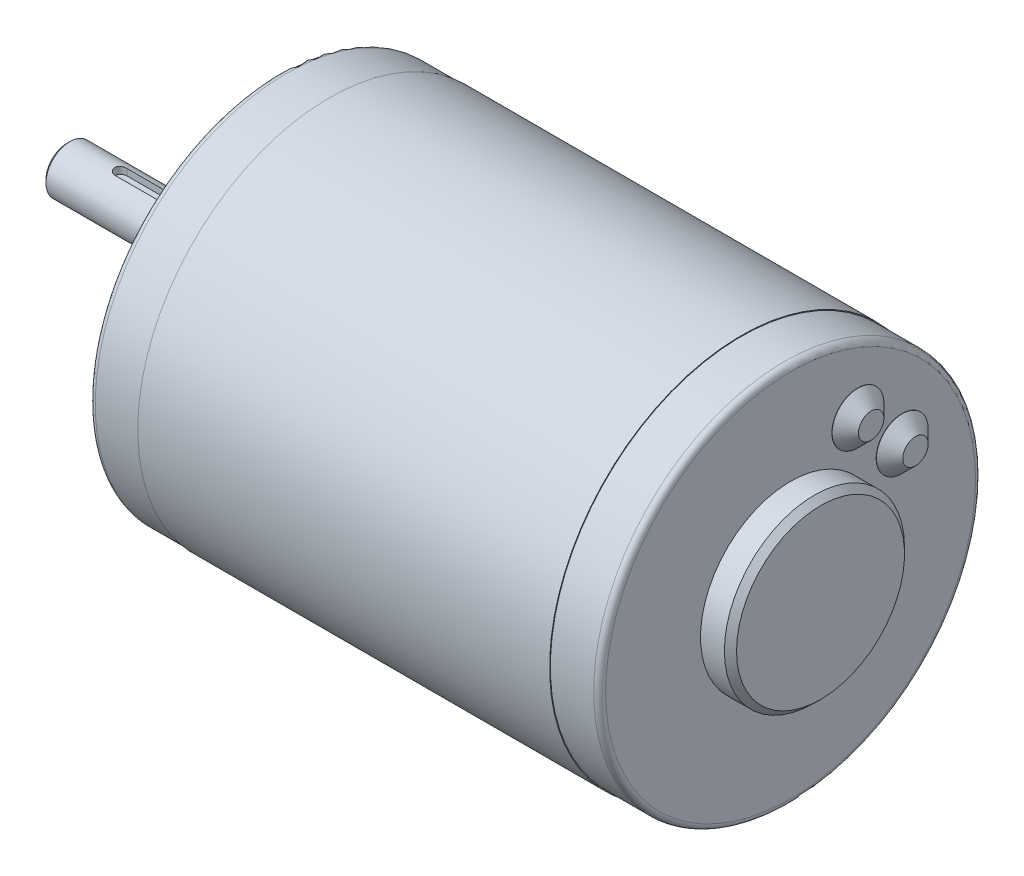
ISO-10303-21;
HEADER;
FILE_DESCRIPTION(('STEP AP214'),'2;1');
FILE_NAME('part.step','',(''),(''),'','','');
FILE_SCHEMA(('AUTOMOTIVE_DESIGN { 1 0 10303 214 1 1 1 1 }'));
ENDSEC;
DATA;
#1=APPLICATION_CONTEXT('core data for automotive mechanical design processes');
#2=APPLICATION_PROTOCOL_DEFINITION('international standard','automotive_design',2000,#1);
#3=PRODUCT_CONTEXT('',#1,'mechanical');
#4=PRODUCT('Part','Part','',(#3));
#5=PRODUCT_RELATED_PRODUCT_CATEGORY('part','',(#4));
#6=PRODUCT_DEFINITION_FORMATION('','',#4);
#7=PRODUCT_DEFINITION_CONTEXT('part definition',#1,'design');
#8=PRODUCT_DEFINITION('design','',#6,#7);
#9=PRODUCT_DEFINITION_SHAPE('','',#8);
#10=(LENGTH_UNIT() NAMED_UNIT(*) SI_UNIT(.MILLI.,.METRE.));
#11=(NAMED_UNIT(*) PLANE_ANGLE_UNIT() SI_UNIT($,.RADIAN.));
#12=(NAMED_UNIT(*) SI_UNIT($,.STERADIAN.) SOLID_ANGLE_UNIT());
#13=UNCERTAINTY_MEASURE_WITH_UNIT(LENGTH_MEASURE(1.E-05),#10,'distance_accuracy_value','');
#14=(GEOMETRIC_REPRESENTATION_CONTEXT(3) GLOBAL_UNCERTAINTY_ASSIGNED_CONTEXT((#13)) GLOBAL_UNIT_ASSIGNED_CONTEXT((#10,
#11,#12)) REPRESENTATION_CONTEXT('',''));
#15=CARTESIAN_POINT('',(0.,0.,0.));
#16=DIRECTION('',(0.,0.,1.));
#17=DIRECTION('',(1.,0.,0.));
#18=AXIS2_PLACEMENT_3D('',#15,#16,#17);
#19=CARTESIAN_POINT('',(-27.6,2.79999999999999,-1.));
#20=DIRECTION('',(0.,-1.,0.));
#21=DIRECTION('',(0.,0.,-1.));
#22=AXIS2_PLACEMENT_3D('',#19,#20,#21);
#23=PLANE('',#22);
#24=CARTESIAN_POINT('',(-7.1,2.79999999999999,0.));
#25=DIRECTION('',(0.,1.,0.));
#26=DIRECTION('',(0.,0.,1.));
#27=AXIS2_PLACEMENT_3D('',#24,#25,#26);
#28=CIRCLE('',#27,1.);
#29=CARTESIAN_POINT('',(-7.1,2.79999999999999,1.));
#30=VERTEX_POINT('',#29);
#31=CARTESIAN_POINT('',(-7.1,2.79999999999999,-1.));
#32=VERTEX_POINT('',#31);
#33=EDGE_CURVE('E81',#30,#32,#28,.T.);
#34=ORIENTED_EDGE('',*,*,#33,.T.);
#35=DIRECTION('',(1.,0.,0.));
#36=VECTOR('',#35,1.);
#37=CARTESIAN_POINT('',(-27.6,2.79999999999999,-1.));
#38=LINE('',#37,#36);
#39=CARTESIAN_POINT('',(-26.6,2.79999999999999,-1.));
#40=VERTEX_POINT('',#39);
#41=EDGE_CURVE('E76',#40,#32,#38,.T.);
#42=ORIENTED_EDGE('',*,*,#41,.F.);
#43=CARTESIAN_POINT('',(-26.6,2.79999999999999,0.));
#44=DIRECTION('',(0.,-1.,0.));
#45=DIRECTION('',(0.,0.,-1.));
#46=AXIS2_PLACEMENT_3D('',#43,#44,#45);
#47=CIRCLE('',#46,1.);
#48=CARTESIAN_POINT('',(-26.6,2.79999999999999,1.));
#49=VERTEX_POINT('',#48);
#50=EDGE_CURVE('E78',#40,#49,#47,.F.);
#51=ORIENTED_EDGE('',*,*,#50,.T.);
#52=DIRECTION('',(1.,0.,0.));
#53=VECTOR('',#52,1.);
#54=CARTESIAN_POINT('',(-27.6,2.79999999999999,1.));
#55=LINE('',#54,#53);
#56=EDGE_CURVE('E104',#49,#30,#55,.T.);
#57=ORIENTED_EDGE('',*,*,#56,.T.);
#58=EDGE_LOOP('',(#34,#42,#51,#57));
#59=FACE_BOUND('',#58,.T.);
#60=ADVANCED_FACE('F18',(#59),#23,.F.);
#61=CARTESIAN_POINT('',(-35.6,0.,0.));
#62=DIRECTION('',(-1.,0.,0.));
#63=DIRECTION('',(0.,0.,1.));
#64=AXIS2_PLACEMENT_3D('',#61,#62,#63);
#65=PLANE('',#64);
#66=CARTESIAN_POINT('',(-35.6000000000449,0.,0.));
#67=DIRECTION('',(1.,0.,0.));
#68=DIRECTION('',(0.,0.,-1.));
#69=AXIS2_PLACEMENT_3D('',#66,#67,#68);
#70=CIRCLE('',#69,3.49999999997408);
#71=CARTESIAN_POINT('',(-35.6000000000449,0.,-3.49999999997408));
#72=VERTEX_POINT('',#71);
#73=EDGE_CURVE('E326',#72,#72,#70,.T.);
#74=ORIENTED_EDGE('',*,*,#73,.F.);
#75=EDGE_LOOP('',(#74));
#76=FACE_BOUND('',#75,.T.);
#77=ADVANCED_FACE('F582',(#76),#65,.T.);
#78=CARTESIAN_POINT('',(-26.6,3.87298334620741,0.));
#79=DIRECTION('',(0.,-1.,0.));
#80=DIRECTION('',(0.,0.,-1.));
#81=AXIS2_PLACEMENT_3D('',#78,#79,#80);
#82=CYLINDRICAL_SURFACE('',#81,1.);
#83=CARTESIAN_POINT('',(-26.6,3.87298334620741,1.));
#84=CARTESIAN_POINT('',(-26.6276629851065,3.87298148580177,1.00000033749611));
#85=CARTESIAN_POINT('',(-26.6553122630182,3.8732800994947,0.998851407375366));
#86=CARTESIAN_POINT('',(-26.7104040353036,3.87445904774558,0.994271295395754));
#87=CARTESIAN_POINT('',(-26.7378465636871,3.87533928441687,0.990840497572679));
#88=CARTESIAN_POINT('',(-26.8194531732088,3.87881710972053,0.977175239382526));
#89=CARTESIAN_POINT('',(-26.8730564684822,3.88225203148808,0.963567695172493));
#90=CARTESIAN_POINT('',(-26.977124673782,3.89095422588002,0.927798076247996));
#91=CARTESIAN_POINT('',(-27.0275898782129,3.89622132630929,0.905636805423835));
#92=CARTESIAN_POINT('',(-27.1241114486473,3.90799134471939,0.853415378025864));
#93=CARTESIAN_POINT('',(-27.170166627891,3.91449459395647,0.823353103356932));
#94=CARTESIAN_POINT('',(-27.2575438819061,3.92816262398025,0.755484471828069));
#95=CARTESIAN_POINT('',(-27.2987548862455,3.93533791028915,0.717537268783975));
#96=CARTESIAN_POINT('',(-27.3743020894827,3.94945104396193,0.635275780516229));
#97=CARTESIAN_POINT('',(-27.4086371894679,3.95638885322537,0.59096047947883));
#98=CARTESIAN_POINT('',(-27.4699110016186,3.96936182283248,0.496456899401689));
#99=CARTESIAN_POINT('',(-27.496739895984,3.9753830468173,0.446195340334472));
#100=CARTESIAN_POINT('',(-27.5415247341967,3.98572346250588,0.341702590842916));
#101=CARTESIAN_POINT('',(-27.5594824242998,3.990042989147,0.287472184083007));
#102=CARTESIAN_POINT('',(-27.5856589927774,3.99641900005128,0.177744108525158));
#103=CARTESIAN_POINT('',(-27.5940676724228,3.998519529013,0.122294322002856));
#104=CARTESIAN_POINT('',(-27.6015033715433,4.00037438150815,0.0107327756816781));
#105=CARTESIAN_POINT('',(-27.6005315701923,4.00012899993444,-0.0453789000287067));
#106=CARTESIAN_POINT('',(-27.5893700363146,3.99735237365735,-0.155352492972096));
#107=CARTESIAN_POINT('',(-27.5793853834005,3.9948719867736,-0.209236701739855));
#108=CARTESIAN_POINT('',(-27.5508113208173,3.98796330636495,-0.31453871108434));
#109=CARTESIAN_POINT('',(-27.5322215304314,3.98353492665556,-0.365956402423988));
#110=CARTESIAN_POINT('',(-27.4867987193294,3.97314997761798,-0.46540728602454));
#111=CARTESIAN_POINT('',(-27.4598926057672,3.96717993827555,-0.513405629602248));
#112=CARTESIAN_POINT('',(-27.3986568701665,3.95435945541919,-0.604276631230015));
#113=CARTESIAN_POINT('',(-27.3643261297468,3.94750887933198,-0.64714851556229));
#114=CARTESIAN_POINT('',(-27.2881210879187,3.93345566022865,-0.727769389708492));
#115=CARTESIAN_POINT('',(-27.2460683634602,3.92624850477685,-0.765349103054128));
#116=CARTESIAN_POINT('',(-27.1561701330723,3.91246168284006,-0.832969575186237));
#117=CARTESIAN_POINT('',(-27.1083230467164,3.90588218842993,-0.863008270245062));
#118=CARTESIAN_POINT('',(-27.0078544021762,3.89407813586325,-0.914804709285961));
#119=CARTESIAN_POINT('',(-26.9552085351039,3.88886106009136,-0.936517017887269));
#120=CARTESIAN_POINT('',(-26.8468830715817,3.88047058807054,-0.970702351849828));
#121=CARTESIAN_POINT('',(-26.7912081448502,3.87729413761435,-0.983189189212131));
#122=CARTESIAN_POINT('',(-26.7125426192411,3.87455290681524,-0.993904635150938));
#123=CARTESIAN_POINT('',(-26.6900802967868,3.87396523110859,-0.996190790966708));
#124=CARTESIAN_POINT('',(-26.6450822100907,3.87318062488974,-0.999236757697394));
#125=CARTESIAN_POINT('',(-26.6225466240447,3.87298306219461,-0.999999038096045));
#126=CARTESIAN_POINT('',(-26.6,3.87298334620741,-1.));
#127=B_SPLINE_CURVE_WITH_KNOTS('',3,(#83,#84,#85,#86,#87,#88,#89,#90,#91,#92,#93,#94,#95,#96,
#97,#98,#99,#100,#101,#102,#103,#104,#105,#106,#107,#108,#109,#110,#111,#112,#113,#114,#115,
#116,#117,#118,#119,#120,#121,#122,#123,#124,#125,#126),.UNSPECIFIED.,.F.,.F.,(4,2,2,2,2,2,2,2,
2,2,2,2,2,2,2,2,2,2,2,2,2,4),(0.,0.0829365303397727,0.165859106084653,0.331229963080318,
0.496585282091499,0.661984974726751,0.830641897427976,0.999325753539196,1.17036187098235,
1.34136430732425,1.50890481515325,1.67642426256639,1.84022545479276,2.00403389475838,
2.16932509450376,2.33464120964329,2.50441429534542,2.67423379180967,2.84496720161068,
3.01544447539986,3.08315848722649,3.15076267731671),.UNSPECIFIED.);
#128=CARTESIAN_POINT('',(-26.6,3.87298334620741,1.));
#129=VERTEX_POINT('',#128);
#130=CARTESIAN_POINT('',(-26.6,3.87298334620741,-1.));
#131=VERTEX_POINT('',#130);
#132=EDGE_CURVE('E162',#129,#131,#127,.T.);
#133=ORIENTED_EDGE('',*,*,#132,.F.);
#134=DIRECTION('',(0.,1.,0.));
#135=VECTOR('',#134,1.);
#136=CARTESIAN_POINT('',(-26.6,2.79999999999999,1.));
#137=LINE('',#136,#135);
#138=EDGE_CURVE('E91',#129,#49,#137,.F.);
#139=ORIENTED_EDGE('',*,*,#138,.T.);
#140=ORIENTED_EDGE('',*,*,#50,.F.);
#141=DIRECTION('',(0.,1.,0.));
#142=VECTOR('',#141,1.);
#143=CARTESIAN_POINT('',(-26.6,2.79999999999999,-1.));
#144=LINE('',#143,#142);
#145=EDGE_CURVE('E85',#131,#40,#144,.F.);
#146=ORIENTED_EDGE('',*,*,#145,.F.);
#147=EDGE_LOOP('',(#133,#139,#140,#146));
#148=FACE_BOUND('',#147,.T.);
#149=ADVANCED_FACE('F88',(#148),#82,.F.);
#150=CARTESIAN_POINT('',(-27.6,2.79999999999999,-1.));
#151=DIRECTION('',(0.,0.,1.));
#152=DIRECTION('',(1.,0.,0.));
#153=AXIS2_PLACEMENT_3D('',#150,#151,#152);
#154=PLANE('',#153);
#155=DIRECTION('',(1.,0.,0.));
#156=VECTOR('',#155,1.);
#157=CARTESIAN_POINT('',(0.,3.87298334620741,-1.));
#158=LINE('',#157,#156);
#159=CARTESIAN_POINT('',(-7.1,3.87298334620741,-1.));
#160=VERTEX_POINT('',#159);
#161=EDGE_CURVE('E96',#131,#160,#158,.T.);
#162=ORIENTED_EDGE('',*,*,#161,.F.);
#163=ORIENTED_EDGE('',*,*,#145,.T.);
#164=ORIENTED_EDGE('',*,*,#41,.T.);
#165=DIRECTION('',(0.,1.,0.));
#166=VECTOR('',#165,1.);
#167=CARTESIAN_POINT('',(-7.1,2.79999999999999,-1.));
#168=LINE('',#167,#166);
#169=EDGE_CURVE('E99',#32,#160,#168,.T.);
#170=ORIENTED_EDGE('',*,*,#169,.T.);
#171=EDGE_LOOP('',(#162,#163,#164,#170));
#172=FACE_BOUND('',#171,.T.);
#173=ADVANCED_FACE('F94',(#172),#154,.T.);
#174=CARTESIAN_POINT('',(-7.1,2.79999999999999,0.));
#175=DIRECTION('',(0.,1.,0.));
#176=DIRECTION('',(0.,0.,1.));
#177=AXIS2_PLACEMENT_3D('',#174,#175,#176);
#178=CYLINDRICAL_SURFACE('',#177,1.);
#179=ORIENTED_EDGE('',*,*,#33,.F.);
#180=DIRECTION('',(0.,1.,0.));
#181=VECTOR('',#180,1.);
#182=CARTESIAN_POINT('',(-7.1,2.79999999999999,1.));
#183=LINE('',#182,#181);
#184=CARTESIAN_POINT('',(-7.1,3.87298334620741,1.));
#185=VERTEX_POINT('',#184);
#186=EDGE_CURVE('E105',#30,#185,#183,.T.);
#187=ORIENTED_EDGE('',*,*,#186,.T.);
#188=CARTESIAN_POINT('',(-7.1,3.87298334620741,-1.));
#189=CARTESIAN_POINT('',(-7.07233701489346,3.87298148580177,-1.00000033749611));
#190=CARTESIAN_POINT('',(-7.04468773698177,3.8732800994947,-0.998851407375366));
#191=CARTESIAN_POINT('',(-6.98959596469644,3.87445904774558,-0.994271295395754));
#192=CARTESIAN_POINT('',(-6.96215343631291,3.87533928441687,-0.990840497572679));
#193=CARTESIAN_POINT('',(-6.88054682679116,3.87881710972053,-0.977175239382526));
#194=CARTESIAN_POINT('',(-6.82694353151779,3.88225203148808,-0.963567695172493));
#195=CARTESIAN_POINT('',(-6.72287532621804,3.89095422588002,-0.927798076247997));
#196=CARTESIAN_POINT('',(-6.67241012178714,3.89622132630929,-0.905636805423836));
#197=CARTESIAN_POINT('',(-6.57588855135267,3.90799134471939,-0.853415378025865));
#198=CARTESIAN_POINT('',(-6.52983337210904,3.91449459395647,-0.823353103356933));
#199=CARTESIAN_POINT('',(-6.4424561180939,3.92816262398025,-0.755484471828069));
#200=CARTESIAN_POINT('',(-6.40124511375448,3.93533791028915,-0.717537268783976));
#201=CARTESIAN_POINT('',(-6.32569791051729,3.94945104396193,-0.63527578051623));
#202=CARTESIAN_POINT('',(-6.29136281053206,3.95638885322537,-0.590960479478831));
#203=CARTESIAN_POINT('',(-6.23008899838136,3.96936182283248,-0.496456899401691));
#204=CARTESIAN_POINT('',(-6.20326010401603,3.9753830468173,-0.446195340334474));
#205=CARTESIAN_POINT('',(-6.1584752658033,3.98572346250588,-0.341702590842919));
#206=CARTESIAN_POINT('',(-6.14051757570017,3.990042989147,-0.28747218408301));
#207=CARTESIAN_POINT('',(-6.11434100722257,3.99641900005128,-0.17774410852516));
#208=CARTESIAN_POINT('',(-6.10593232757718,3.998519529013,-0.122294322002858));
#209=CARTESIAN_POINT('',(-6.09849662845671,4.00037438150815,-0.0107327756816796));
#210=CARTESIAN_POINT('',(-6.09946842980766,4.00012899993444,0.0453789000287057));
#211=CARTESIAN_POINT('',(-6.11062996368545,3.99735237365735,0.155352492972096));
#212=CARTESIAN_POINT('',(-6.12061461659948,3.9948719867736,0.209236701739855));
#213=CARTESIAN_POINT('',(-6.14918867918275,3.98796330636495,0.31453871108434));
#214=CARTESIAN_POINT('',(-6.16777846956858,3.98353492665556,0.365956402423988));
#215=CARTESIAN_POINT('',(-6.21320128067065,3.97314997761798,0.465407286024539));
#216=CARTESIAN_POINT('',(-6.24010739423284,3.96717993827555,0.513405629602248));
#217=CARTESIAN_POINT('',(-6.30134312983347,3.95435945541919,0.604276631230014));
#218=CARTESIAN_POINT('',(-6.33567387025322,3.94750887933198,0.647148515562289));
#219=CARTESIAN_POINT('',(-6.41187891208131,3.93345566022865,0.72776938970849));
#220=CARTESIAN_POINT('',(-6.45393163653981,3.92624850477685,0.765349103054127));
#221=CARTESIAN_POINT('',(-6.54382986692773,3.91246168284006,0.832969575186237));
#222=CARTESIAN_POINT('',(-6.59167695328356,3.90588218842993,0.863008270245062));
#223=CARTESIAN_POINT('',(-6.69214559782377,3.89407813586325,0.914804709285962));
#224=CARTESIAN_POINT('',(-6.74479146489609,3.88886106009136,0.936517017887269));
#225=CARTESIAN_POINT('',(-6.85311692841829,3.88047058807055,0.970702351849829));
#226=CARTESIAN_POINT('',(-6.90879185514984,3.87729413761435,0.983189189212132));
#227=CARTESIAN_POINT('',(-6.9874573807589,3.87455290681524,0.993904635150938));
#228=CARTESIAN_POINT('',(-7.00991970321318,3.87396523110859,0.996190790966708));
#229=CARTESIAN_POINT('',(-7.05491778990932,3.87318062488974,0.999236757697394));
#230=CARTESIAN_POINT('',(-7.07745337595529,3.87298306219461,0.999999038096045));
#231=CARTESIAN_POINT('',(-7.1,3.87298334620741,1.));
#232=B_SPLINE_CURVE_WITH_KNOTS('',3,(#188,#189,#190,#191,#192,#193,#194,#195,#196,#197,#198,
#199,#200,#201,#202,#203,#204,#205,#206,#207,#208,#209,#210,#211,#212,#213,#214,#215,#216,#217,
#218,#219,#220,#221,#222,#223,#224,#225,#226,#227,#228,#229,#230,#231),.UNSPECIFIED.,.F.,.F.,(4,
2,2,2,2,2,2,2,2,2,2,2,2,2,2,2,2,2,2,2,2,4),(0.,0.0829365303397693,0.165859106084651,
0.331229963080317,0.496585282091498,0.661984974726749,0.830641897427974,0.999325753539193,
1.17036187098235,1.34136430732424,1.50890481515325,1.67642426256639,1.84022545479276,
2.00403389475838,2.16932509450376,2.33464120964329,2.50441429534542,2.67423379180967,
2.84496720161068,3.01544447539986,3.08315848722648,3.15076267731671),.UNSPECIFIED.);
#233=EDGE_CURVE('E153',#160,#185,#232,.T.);
#234=ORIENTED_EDGE('',*,*,#233,.F.);
#235=ORIENTED_EDGE('',*,*,#169,.F.);
#236=EDGE_LOOP('',(#179,#187,#234,#235));
#237=FACE_BOUND('',#236,.T.);
#238=ADVANCED_FACE('F168',(#237),#178,.F.);
#239=CARTESIAN_POINT('',(-27.6,2.79999999999999,1.));
#240=DIRECTION('',(0.,0.,1.));
#241=DIRECTION('',(1.,0.,0.));
#242=AXIS2_PLACEMENT_3D('',#239,#240,#241);
#243=PLANE('',#242);
#244=ORIENTED_EDGE('',*,*,#186,.F.);
#245=ORIENTED_EDGE('',*,*,#56,.F.);
#246=ORIENTED_EDGE('',*,*,#138,.F.);
#247=DIRECTION('',(1.,0.,0.));
#248=VECTOR('',#247,1.);
#249=CARTESIAN_POINT('',(0.,3.87298334620741,1.));
#250=LINE('',#249,#248);
#251=EDGE_CURVE('E161',#185,#129,#250,.F.);
#252=ORIENTED_EDGE('',*,*,#251,.F.);
#253=EDGE_LOOP('',(#244,#245,#246,#252));
#254=FACE_BOUND('',#253,.T.);
#255=ADVANCED_FACE('F183',(#254),#243,.F.);
#256=CARTESIAN_POINT('',(-35.0999999999999,0.,0.));
#257=DIRECTION('',(1.,0.,0.));
#258=DIRECTION('',(0.,0.,-1.));
#259=AXIS2_PLACEMENT_3D('',#256,#257,#258);
#260=CONICAL_SURFACE('',#259,3.99999999996226,0.785398163340605);
#261=ORIENTED_EDGE('',*,*,#73,.T.);
#262=EDGE_LOOP('',(#261));
#263=FACE_BOUND('',#262,.T.);
#264=CARTESIAN_POINT('',(-35.1,0.,0.));
#265=DIRECTION('',(1.,0.,0.));
#266=DIRECTION('',(0.,0.,-1.));
#267=AXIS2_PLACEMENT_3D('',#264,#265,#266);
#268=CIRCLE('',#267,4.);
#269=CARTESIAN_POINT('',(-35.1,0.,-4.));
#270=VERTEX_POINT('',#269);
#271=EDGE_CURVE('E152',#270,#270,#268,.T.);
#272=ORIENTED_EDGE('',*,*,#271,.F.);
#273=EDGE_LOOP('',(#272));
#274=FACE_BOUND('',#273,.T.);
#275=ADVANCED_FACE('F178',(#263,#274),#260,.T.);
#276=CARTESIAN_POINT('',(0.,0.,0.));
#277=DIRECTION('',(1.,0.,0.));
#278=DIRECTION('',(0.,0.,-1.));
#279=AXIS2_PLACEMENT_3D('',#276,#277,#278);
#280=CYLINDRICAL_SURFACE('',#279,4.);
#281=ORIENTED_EDGE('',*,*,#271,.T.);
#282=EDGE_LOOP('',(#281));
#283=FACE_BOUND('',#282,.T.);
#284=CARTESIAN_POINT('',(-4.,0.,0.));
#285=DIRECTION('',(1.,0.,0.));
#286=DIRECTION('',(0.,0.,-1.));
#287=AXIS2_PLACEMENT_3D('',#284,#285,#286);
#288=CIRCLE('',#287,4.);
#289=CARTESIAN_POINT('',(-4.,0.,-4.));
#290=VERTEX_POINT('',#289);
#291=EDGE_CURVE('E149',#290,#290,#288,.T.);
#292=ORIENTED_EDGE('',*,*,#291,.F.);
#293=EDGE_LOOP('',(#292));
#294=FACE_BOUND('',#293,.T.);
#295=ORIENTED_EDGE('',*,*,#233,.T.);
#296=ORIENTED_EDGE('',*,*,#251,.T.);
#297=ORIENTED_EDGE('',*,*,#132,.T.);
#298=ORIENTED_EDGE('',*,*,#161,.T.);
#299=EDGE_LOOP('',(#295,#296,#297,#298));
#300=FACE_BOUND('',#299,.T.);
#301=ADVANCED_FACE('F172',(#283,#294,#300),#280,.T.);
#302=CARTESIAN_POINT('',(-4.,4.,0.));
#303=DIRECTION('',(-1.,0.,0.));
#304=DIRECTION('',(0.,0.,1.));
#305=AXIS2_PLACEMENT_3D('',#302,#303,#304);
#306=PLANE('',#305);
#307=ORIENTED_EDGE('',*,*,#291,.T.);
#308=EDGE_LOOP('',(#307));
#309=FACE_BOUND('',#308,.T.);
#310=CARTESIAN_POINT('',(-4.,0.,0.));
#311=DIRECTION('',(1.,0.,0.));
#312=DIRECTION('',(0.,1.,0.));
#313=AXIS2_PLACEMENT_3D('',#310,#311,#312);
#314=CIRCLE('',#313,8.509);
#315=CARTESIAN_POINT('',(-4.,8.509,0.));
#316=VERTEX_POINT('',#315);
#317=EDGE_CURVE('E146',#316,#316,#314,.T.);
#318=ORIENTED_EDGE('',*,*,#317,.F.);
#319=EDGE_LOOP('',(#318));
#320=FACE_BOUND('',#319,.T.);
#321=ADVANCED_FACE('F177',(#309,#320),#306,.T.);
#322=CARTESIAN_POINT('',(87.4639,18.6070906828553,-11.2073596390943));
#323=DIRECTION('',(1.,0.,0.));
#324=DIRECTION('',(0.,0.,-1.));
#325=AXIS2_PLACEMENT_3D('',#322,#323,#324);
#326=PLANE('',#325);
#327=CARTESIAN_POINT('',(87.463899999932,18.6070906828553,-11.2073596390943));
#328=DIRECTION('',(-1.,0.,0.));
#329=DIRECTION('',(0.,0.,1.));
#330=AXIS2_PLACEMENT_3D('',#327,#328,#329);
#331=CIRCLE('',#330,2.11800000003146);
#332=CARTESIAN_POINT('',(87.463899999932,18.6070906828553,-9.08935963906288));
#333=VERTEX_POINT('',#332);
#334=EDGE_CURVE('E143',#333,#333,#331,.T.);
#335=ORIENTED_EDGE('',*,*,#334,.F.);
#336=EDGE_LOOP('',(#335));
#337=FACE_BOUND('',#336,.T.);
#338=ADVANCED_FACE('F534',(#337),#326,.T.);
#339=CARTESIAN_POINT('',(90.216,15.0368,0.));
#340=DIRECTION('',(1.,0.,0.));
#341=DIRECTION('',(0.,0.,-1.));
#342=AXIS2_PLACEMENT_3D('',#339,#340,#341);
#343=PLANE('',#342);
#344=CARTESIAN_POINT('',(90.216,0.,0.));
#345=DIRECTION('',(-1.,0.,0.));
#346=DIRECTION('',(0.,0.,1.));
#347=AXIS2_PLACEMENT_3D('',#344,#345,#346);
#348=CIRCLE('',#347,14.0208);
#349=CARTESIAN_POINT('',(90.216,0.,14.0208));
#350=VERTEX_POINT('',#349);
#351=EDGE_CURVE('E140',#350,#350,#348,.T.);
#352=ORIENTED_EDGE('',*,*,#351,.F.);
#353=EDGE_LOOP('',(#352));
#354=FACE_BOUND('',#353,.T.);
#355=ADVANCED_FACE('F525',(#354),#343,.T.);
#356=CARTESIAN_POINT('',(87.4639,11.2073596390943,-18.6070906828553));
#357=DIRECTION('',(1.,0.,0.));
#358=DIRECTION('',(0.,0.,-1.));
#359=AXIS2_PLACEMENT_3D('',#356,#357,#358);
#360=PLANE('',#359);
#361=CARTESIAN_POINT('',(87.463899999932,11.2073596390943,-18.6070906828553));
#362=DIRECTION('',(-1.,0.,0.));
#363=DIRECTION('',(0.,0.,1.));
#364=AXIS2_PLACEMENT_3D('',#361,#362,#363);
#365=CIRCLE('',#364,2.1180000000021);
#366=CARTESIAN_POINT('',(87.463899999932,11.2073596390943,-16.4890906828532));
#367=VERTEX_POINT('',#366);
#368=EDGE_CURVE('E136',#367,#367,#365,.T.);
#369=ORIENTED_EDGE('',*,*,#368,.F.);
#370=EDGE_LOOP('',(#369));
#371=FACE_BOUND('',#370,.T.);
#372=ADVANCED_FACE('F516',(#371),#360,.T.);
#373=CARTESIAN_POINT('',(13.6143999999945,25.4,0.));
#374=DIRECTION('',(-1.,0.,0.));
#375=DIRECTION('',(0.,0.,1.));
#376=AXIS2_PLACEMENT_3D('',#373,#374,#375);
#377=CONICAL_SURFACE('',#376,2.01929999997219,1.02974425867198);
#378=CARTESIAN_POINT('',(14.827717847993,25.4,0.));
#379=VERTEX_POINT('',#378);
#380=VERTEX_LOOP('',#379);
#381=FACE_BOUND('',#380,.T.);
#382=CARTESIAN_POINT('',(13.6144,25.4,0.));
#383=DIRECTION('',(-1.,0.,0.));
#384=DIRECTION('',(0.,0.,1.));
#385=AXIS2_PLACEMENT_3D('',#382,#383,#384);
#386=CIRCLE('',#385,2.0193);
#387=CARTESIAN_POINT('',(13.6144,25.4,2.0193));
#388=VERTEX_POINT('',#387);
#389=EDGE_CURVE('E139',#388,#388,#386,.T.);
#390=ORIENTED_EDGE('',*,*,#389,.T.);
#391=EDGE_LOOP('',(#390));
#392=FACE_BOUND('',#391,.T.);
#393=ADVANCED_FACE('F507',(#381,#392),#377,.F.);
#394=CARTESIAN_POINT('',(13.6143999999945,-25.4,0.));
#395=DIRECTION('',(-1.,0.,0.));
#396=DIRECTION('',(0.,0.,1.));
#397=AXIS2_PLACEMENT_3D('',#394,#395,#396);
#398=CONICAL_SURFACE('',#397,2.01929999997219,1.02974425867198);
#399=CARTESIAN_POINT('',(14.827717847993,-25.4,0.));
#400=VERTEX_POINT('',#399);
#401=VERTEX_LOOP('',#400);
#402=FACE_BOUND('',#401,.T.);
#403=CARTESIAN_POINT('',(13.6144,-25.4,0.));
#404=DIRECTION('',(-1.,0.,0.));
#405=DIRECTION('',(0.,0.,1.));
#406=AXIS2_PLACEMENT_3D('',#403,#404,#405);
#407=CIRCLE('',#406,2.0193);
#408=CARTESIAN_POINT('',(13.6144,-25.4,2.0193));
#409=VERTEX_POINT('',#408);
#410=EDGE_CURVE('E316',#409,#409,#407,.T.);
#411=ORIENTED_EDGE('',*,*,#410,.T.);
#412=EDGE_LOOP('',(#411));
#413=FACE_BOUND('',#412,.T.);
#414=ADVANCED_FACE('F498',(#402,#413),#398,.F.);
#415=CARTESIAN_POINT('',(-2.984,0.,0.));
#416=DIRECTION('',(1.,0.,0.));
#417=DIRECTION('',(0.,1.,0.));
#418=AXIS2_PLACEMENT_3D('',#415,#416,#417);
#419=CONICAL_SURFACE('',#418,9.525,0.78539816339745);
#420=ORIENTED_EDGE('',*,*,#317,.T.);
#421=EDGE_LOOP('',(#420));
#422=FACE_BOUND('',#421,.T.);
#423=CARTESIAN_POINT('',(-2.984,0.,0.));
#424=DIRECTION('',(1.,0.,0.));
#425=DIRECTION('',(0.,0.,-1.));
#426=AXIS2_PLACEMENT_3D('',#423,#424,#425);
#427=CIRCLE('',#426,9.525);
#428=CARTESIAN_POINT('',(-2.984,0.,-9.525));
#429=VERTEX_POINT('',#428);
#430=EDGE_CURVE('E313',#429,#429,#427,.T.);
#431=ORIENTED_EDGE('',*,*,#430,.F.);
#432=EDGE_LOOP('',(#431));
#433=FACE_BOUND('',#432,.T.);
#434=ADVANCED_FACE('F489',(#422,#433),#419,.T.);
#435=CARTESIAN_POINT('',(85.2639000000295,18.6070906828553,-11.2073596390943));
#436=DIRECTION('',(-1.,0.,0.));
#437=DIRECTION('',(0.,0.,1.));
#438=AXIS2_PLACEMENT_3D('',#435,#436,#437);
#439=CONICAL_SURFACE('',#438,4.31799999987712,0.785398163384529);
#440=CARTESIAN_POINT('',(85.2639,18.6070906828553,-11.2073596390943));
#441=DIRECTION('',(-1.,0.,0.));
#442=DIRECTION('',(0.,0.,1.));
#443=AXIS2_PLACEMENT_3D('',#440,#441,#442);
#444=CIRCLE('',#443,4.318);
#445=CARTESIAN_POINT('',(85.2639,18.6070906828553,-6.88935963909434));
#446=VERTEX_POINT('',#445);
#447=EDGE_CURVE('E310',#446,#446,#444,.T.);
#448=ORIENTED_EDGE('',*,*,#447,.F.);
#449=EDGE_LOOP('',(#448));
#450=FACE_BOUND('',#449,.T.);
#451=ORIENTED_EDGE('',*,*,#334,.T.);
#452=EDGE_LOOP('',(#451));
#453=FACE_BOUND('',#452,.T.);
#454=ADVANCED_FACE('F480',(#450,#453),#439,.T.);
#455=CARTESIAN_POINT('',(89.2,0.,0.));
#456=DIRECTION('',(-1.,0.,0.));
#457=DIRECTION('',(0.,0.,1.));
#458=AXIS2_PLACEMENT_3D('',#455,#456,#457);
#459=CONICAL_SURFACE('',#458,15.0368,0.785398163397449);
#460=ORIENTED_EDGE('',*,*,#351,.T.);
#461=EDGE_LOOP('',(#460));
#462=FACE_BOUND('',#461,.T.);
#463=CARTESIAN_POINT('',(89.2,0.,0.));
#464=DIRECTION('',(1.,0.,0.));
#465=DIRECTION('',(0.,0.,-1.));
#466=AXIS2_PLACEMENT_3D('',#463,#464,#465);
#467=CIRCLE('',#466,15.0368);
#468=CARTESIAN_POINT('',(89.2,0.,-15.0368));
#469=VERTEX_POINT('',#468);
#470=EDGE_CURVE('E307',#469,#469,#467,.F.);
#471=ORIENTED_EDGE('',*,*,#470,.F.);
#472=EDGE_LOOP('',(#471));
#473=FACE_BOUND('',#472,.T.);
#474=ADVANCED_FACE('F471',(#462,#473),#459,.T.);
#475=CARTESIAN_POINT('',(85.2639000000863,11.2073596390943,-18.6070906828553));
#476=DIRECTION('',(-1.,0.,0.));
#477=DIRECTION('',(0.,0.,1.));
#478=AXIS2_PLACEMENT_3D('',#475,#476,#477);
#479=CONICAL_SURFACE('',#478,4.31799999990461,0.785398163410367);
#480=CARTESIAN_POINT('',(85.2639,11.2073596390943,-18.6070906828553));
#481=DIRECTION('',(-1.,0.,0.));
#482=DIRECTION('',(0.,0.,1.));
#483=AXIS2_PLACEMENT_3D('',#480,#481,#482);
#484=CIRCLE('',#483,4.318);
#485=CARTESIAN_POINT('',(85.2639,11.2073596390943,-14.2890906828553));
#486=VERTEX_POINT('',#485);
#487=EDGE_CURVE('E135',#486,#486,#484,.T.);
#488=ORIENTED_EDGE('',*,*,#487,.F.);
#489=EDGE_LOOP('',(#488));
#490=FACE_BOUND('',#489,.T.);
#491=ORIENTED_EDGE('',*,*,#368,.T.);
#492=EDGE_LOOP('',(#491));
#493=FACE_BOUND('',#492,.T.);
#494=ADVANCED_FACE('F462',(#490,#493),#479,.T.);
#495=CARTESIAN_POINT('',(0.,25.4,0.));
#496=DIRECTION('',(-1.,0.,0.));
#497=DIRECTION('',(0.,0.,1.));
#498=AXIS2_PLACEMENT_3D('',#495,#496,#497);
#499=CYLINDRICAL_SURFACE('',#498,2.0193);
#500=CARTESIAN_POINT('',(0.,25.4,0.));
#501=DIRECTION('',(-1.,0.,0.));
#502=DIRECTION('',(0.,0.,1.));
#503=AXIS2_PLACEMENT_3D('',#500,#501,#502);
#504=CIRCLE('',#503,2.0193);
#505=CARTESIAN_POINT('',(0.,25.4,2.0193));
#506=VERTEX_POINT('',#505);
#507=EDGE_CURVE('E132',#506,#506,#504,.F.);
#508=ORIENTED_EDGE('',*,*,#507,.F.);
#509=EDGE_LOOP('',(#508));
#510=FACE_BOUND('',#509,.T.);
#511=ORIENTED_EDGE('',*,*,#389,.F.);
#512=EDGE_LOOP('',(#511));
#513=FACE_BOUND('',#512,.T.);
#514=ADVANCED_FACE('F453',(#510,#513),#499,.F.);
#515=CARTESIAN_POINT('',(0.,-25.4,0.));
#516=DIRECTION('',(-1.,0.,0.));
#517=DIRECTION('',(0.,0.,1.));
#518=AXIS2_PLACEMENT_3D('',#515,#516,#517);
#519=CYLINDRICAL_SURFACE('',#518,2.0193);
#520=CARTESIAN_POINT('',(0.,-25.4,0.));
#521=DIRECTION('',(-1.,0.,0.));
#522=DIRECTION('',(0.,0.,1.));
#523=AXIS2_PLACEMENT_3D('',#520,#521,#522);
#524=CIRCLE('',#523,2.0193);
#525=CARTESIAN_POINT('',(0.,-25.4,2.0193));
#526=VERTEX_POINT('',#525);
#527=EDGE_CURVE('E129',#526,#526,#524,.F.);
#528=ORIENTED_EDGE('',*,*,#527,.F.);
#529=EDGE_LOOP('',(#528));
#530=FACE_BOUND('',#529,.T.);
#531=ORIENTED_EDGE('',*,*,#410,.F.);
#532=EDGE_LOOP('',(#531));
#533=FACE_BOUND('',#532,.T.);
#534=ADVANCED_FACE('F444',(#530,#533),#519,.F.);
#535=CARTESIAN_POINT('',(0.,0.,0.));
#536=DIRECTION('',(1.,0.,0.));
#537=DIRECTION('',(0.,0.,-1.));
#538=AXIS2_PLACEMENT_3D('',#535,#536,#537);
#539=CYLINDRICAL_SURFACE('',#538,9.525);
#540=ORIENTED_EDGE('',*,*,#430,.T.);
#541=EDGE_LOOP('',(#540));
#542=FACE_BOUND('',#541,.T.);
#543=CARTESIAN_POINT('',(0.,0.,0.));
#544=DIRECTION('',(1.,0.,0.));
#545=DIRECTION('',(0.,0.,-1.));
#546=AXIS2_PLACEMENT_3D('',#543,#544,#545);
#547=CIRCLE('',#546,9.525);
#548=CARTESIAN_POINT('',(0.,0.,-9.525));
#549=VERTEX_POINT('',#548);
#550=EDGE_CURVE('E126',#549,#549,#547,.T.);
#551=ORIENTED_EDGE('',*,*,#550,.F.);
#552=EDGE_LOOP('',(#551));
#553=FACE_BOUND('',#552,.T.);
#554=ADVANCED_FACE('F435',(#542,#553),#539,.T.);
#555=CARTESIAN_POINT('',(87.4639,18.6070906828553,-11.2073596390943));
#556=DIRECTION('',(-1.,0.,0.));
#557=DIRECTION('',(0.,0.,1.));
#558=AXIS2_PLACEMENT_3D('',#555,#556,#557);
#559=CYLINDRICAL_SURFACE('',#558,4.318);
#560=CARTESIAN_POINT('',(85.216,18.6070906828553,-11.2073596390943));
#561=DIRECTION('',(-1.,0.,0.));
#562=DIRECTION('',(0.,0.,1.));
#563=AXIS2_PLACEMENT_3D('',#560,#561,#562);
#564=CIRCLE('',#563,4.318);
#565=CARTESIAN_POINT('',(85.216,18.6070906828553,-6.88935963909434));
#566=VERTEX_POINT('',#565);
#567=EDGE_CURVE('E123',#566,#566,#564,.T.);
#568=ORIENTED_EDGE('',*,*,#567,.F.);
#569=EDGE_LOOP('',(#568));
#570=FACE_BOUND('',#569,.T.);
#571=ORIENTED_EDGE('',*,*,#447,.T.);
#572=EDGE_LOOP('',(#571));
#573=FACE_BOUND('',#572,.T.);
#574=ADVANCED_FACE('F426',(#570,#573),#559,.T.);
#575=CARTESIAN_POINT('',(0.,0.,0.));
#576=DIRECTION('',(1.,0.,0.));
#577=DIRECTION('',(0.,0.,-1.));
#578=AXIS2_PLACEMENT_3D('',#575,#576,#577);
#579=CYLINDRICAL_SURFACE('',#578,15.0368);
#580=CARTESIAN_POINT('',(85.216,0.,0.));
#581=DIRECTION('',(1.,0.,0.));
#582=DIRECTION('',(0.,0.,-1.));
#583=AXIS2_PLACEMENT_3D('',#580,#581,#582);
#584=CIRCLE('',#583,15.0368);
#585=CARTESIAN_POINT('',(85.216,0.,-15.0368));
#586=VERTEX_POINT('',#585);
#587=EDGE_CURVE('E120',#586,#586,#584,.F.);
#588=ORIENTED_EDGE('',*,*,#587,.F.);
#589=EDGE_LOOP('',(#588));
#590=FACE_BOUND('',#589,.T.);
#591=ORIENTED_EDGE('',*,*,#470,.T.);
#592=EDGE_LOOP('',(#591));
#593=FACE_BOUND('',#592,.T.);
#594=ADVANCED_FACE('F418',(#590,#593),#579,.T.);
#595=CARTESIAN_POINT('',(87.4639,11.2073596390943,-18.6070906828553));
#596=DIRECTION('',(-1.,0.,0.));
#597=DIRECTION('',(0.,0.,1.));
#598=AXIS2_PLACEMENT_3D('',#595,#596,#597);
#599=CYLINDRICAL_SURFACE('',#598,4.318);
#600=CARTESIAN_POINT('',(85.216,11.2073596390943,-18.6070906828553));
#601=DIRECTION('',(-1.,0.,0.));
#602=DIRECTION('',(0.,0.,1.));
#603=AXIS2_PLACEMENT_3D('',#600,#601,#602);
#604=CIRCLE('',#603,4.318);
#605=CARTESIAN_POINT('',(85.216,11.2073596390943,-14.2890906828553));
#606=VERTEX_POINT('',#605);
#607=EDGE_CURVE('E116',#606,#606,#604,.T.);
#608=ORIENTED_EDGE('',*,*,#607,.F.);
#609=EDGE_LOOP('',(#608));
#610=FACE_BOUND('',#609,.T.);
#611=ORIENTED_EDGE('',*,*,#487,.T.);
#612=EDGE_LOOP('',(#611));
#613=FACE_BOUND('',#612,.T.);
#614=ADVANCED_FACE('F410',(#610,#613),#599,.T.);
#615=CARTESIAN_POINT('',(0.,9.525,0.));
#616=DIRECTION('',(-1.,0.,0.));
#617=DIRECTION('',(0.,0.,1.));
#618=AXIS2_PLACEMENT_3D('',#615,#616,#617);
#619=PLANE('',#618);
#620=ORIENTED_EDGE('',*,*,#550,.T.);
#621=EDGE_LOOP('',(#620));
#622=FACE_BOUND('',#621,.T.);
#623=CARTESIAN_POINT('',(0.,0.,0.));
#624=DIRECTION('',(1.,0.,0.));
#625=DIRECTION('',(0.,0.,-1.));
#626=AXIS2_PLACEMENT_3D('',#623,#624,#625);
#627=CIRCLE('',#626,30.877);
#628=CARTESIAN_POINT('',(0.,0.,-30.877));
#629=VERTEX_POINT('',#628);
#630=CARTESIAN_POINT('',(0.,0.,30.877));
#631=VERTEX_POINT('',#630);
#632=EDGE_CURVE('E119',#629,#631,#627,.T.);
#633=ORIENTED_EDGE('',*,*,#632,.F.);
#634=CARTESIAN_POINT('',(0.,0.,0.));
#635=DIRECTION('',(1.,0.,0.));
#636=DIRECTION('',(0.,0.,1.));
#637=AXIS2_PLACEMENT_3D('',#634,#635,#636);
#638=CIRCLE('',#637,30.877);
#639=EDGE_CURVE('E286',#631,#629,#638,.T.);
#640=ORIENTED_EDGE('',*,*,#639,.F.);
#641=EDGE_LOOP('',(#633,#640));
#642=FACE_BOUND('',#641,.T.);
#643=ORIENTED_EDGE('',*,*,#527,.T.);
#644=EDGE_LOOP('',(#643));
#645=FACE_BOUND('',#644,.T.);
#646=ORIENTED_EDGE('',*,*,#507,.T.);
#647=EDGE_LOOP('',(#646));
#648=FACE_BOUND('',#647,.T.);
#649=ADVANCED_FACE('F252',(#622,#642,#645,#648),#619,.T.);
#650=CARTESIAN_POINT('',(85.216,31.877,0.));
#651=DIRECTION('',(1.,0.,0.));
#652=DIRECTION('',(0.,0.,-1.));
#653=AXIS2_PLACEMENT_3D('',#650,#651,#652);
#654=PLANE('',#653);
#655=ORIENTED_EDGE('',*,*,#607,.T.);
#656=EDGE_LOOP('',(#655));
#657=FACE_BOUND('',#656,.T.);
#658=ORIENTED_EDGE('',*,*,#587,.T.);
#659=EDGE_LOOP('',(#658));
#660=FACE_BOUND('',#659,.T.);
#661=CARTESIAN_POINT('',(85.216,0.,0.));
#662=DIRECTION('',(-1.,0.,0.));
#663=DIRECTION('',(0.,0.,1.));
#664=AXIS2_PLACEMENT_3D('',#661,#662,#663);
#665=CIRCLE('',#664,30.877);
#666=CARTESIAN_POINT('',(85.216,0.,30.877));
#667=VERTEX_POINT('',#666);
#668=CARTESIAN_POINT('',(85.216,0.,-30.877));
#669=VERTEX_POINT('',#668);
#670=EDGE_CURVE('E37',#667,#669,#665,.T.);
#671=ORIENTED_EDGE('',*,*,#670,.F.);
#672=CARTESIAN_POINT('',(85.216,0.,0.));
#673=DIRECTION('',(-1.,0.,0.));
#674=DIRECTION('',(0.,0.,-1.));
#675=AXIS2_PLACEMENT_3D('',#672,#673,#674);
#676=CIRCLE('',#675,30.877);
#677=EDGE_CURVE('E234',#669,#667,#676,.T.);
#678=ORIENTED_EDGE('',*,*,#677,.F.);
#679=EDGE_LOOP('',(#671,#678));
#680=FACE_BOUND('',#679,.T.);
#681=ORIENTED_EDGE('',*,*,#567,.T.);
#682=EDGE_LOOP('',(#681));
#683=FACE_BOUND('',#682,.T.);
#684=ADVANCED_FACE('F243',(#657,#660,#680,#683),#654,.T.);
#685=CARTESIAN_POINT('',(0.999999999999999,0.,0.));
#686=DIRECTION('',(-1.,0.,0.));
#687=DIRECTION('',(0.,0.,1.));
#688=AXIS2_PLACEMENT_3D('',#685,#686,#687);
#689=TOROIDAL_SURFACE('',#688,30.877,1.);
#690=CARTESIAN_POINT('',(0.999999999999999,0.,0.));
#691=DIRECTION('',(1.,0.,0.));
#692=DIRECTION('',(0.,0.,-1.));
#693=AXIS2_PLACEMENT_3D('',#690,#691,#692);
#694=CIRCLE('',#693,31.877);
#695=CARTESIAN_POINT('',(0.999999999999999,0.,-31.877));
#696=VERTEX_POINT('',#695);
#697=EDGE_CURVE('E232',#696,#696,#694,.T.);
#698=ORIENTED_EDGE('',*,*,#697,.F.);
#699=EDGE_LOOP('',(#698));
#700=FACE_BOUND('',#699,.T.);
#701=ORIENTED_EDGE('',*,*,#639,.T.);
#702=ORIENTED_EDGE('',*,*,#632,.T.);
#703=EDGE_LOOP('',(#701,#702));
#704=FACE_BOUND('',#703,.T.);
#705=ADVANCED_FACE('F221',(#700,#704),#689,.T.);
#706=CARTESIAN_POINT('',(84.216,0.,0.));
#707=DIRECTION('',(1.,0.,0.));
#708=DIRECTION('',(0.,0.,-1.));
#709=AXIS2_PLACEMENT_3D('',#706,#707,#708);
#710=TOROIDAL_SURFACE('',#709,30.877,1.);
#711=CARTESIAN_POINT('',(84.216,0.,0.));
#712=DIRECTION('',(1.,0.,0.));
#713=DIRECTION('',(0.,0.,-1.));
#714=AXIS2_PLACEMENT_3D('',#711,#712,#713);
#715=CIRCLE('',#714,31.877);
#716=CARTESIAN_POINT('',(84.216,0.,-31.877));
#717=VERTEX_POINT('',#716);
#718=EDGE_CURVE('E115',#717,#717,#715,.F.);
#719=ORIENTED_EDGE('',*,*,#718,.F.);
#720=EDGE_LOOP('',(#719));
#721=FACE_BOUND('',#720,.T.);
#722=ORIENTED_EDGE('',*,*,#677,.T.);
#723=ORIENTED_EDGE('',*,*,#670,.T.);
#724=EDGE_LOOP('',(#722,#723));
#725=FACE_BOUND('',#724,.T.);
#726=ADVANCED_FACE('F216',(#721,#725),#710,.T.);
#727=CARTESIAN_POINT('',(0.,0.,0.));
#728=DIRECTION('',(1.,0.,0.));
#729=DIRECTION('',(0.,0.,-1.));
#730=AXIS2_PLACEMENT_3D('',#727,#728,#729);
#731=CYLINDRICAL_SURFACE('',#730,31.877);
#732=ORIENTED_EDGE('',*,*,#697,.T.);
#733=EDGE_LOOP('',(#732));
#734=FACE_BOUND('',#733,.T.);
#735=CARTESIAN_POINT('',(8.2296,0.,0.));
#736=DIRECTION('',(1.,0.,0.));
#737=DIRECTION('',(0.,0.,-1.));
#738=AXIS2_PLACEMENT_3D('',#735,#736,#737);
#739=CIRCLE('',#738,31.877);
#740=CARTESIAN_POINT('',(8.2296,0.,-31.877));
#741=VERTEX_POINT('',#740);
#742=EDGE_CURVE('E112',#741,#741,#739,.T.);
#743=ORIENTED_EDGE('',*,*,#742,.F.);
#744=EDGE_LOOP('',(#743));
#745=FACE_BOUND('',#744,.T.);
#746=ADVANCED_FACE('F212',(#734,#745),#731,.T.);
#747=CARTESIAN_POINT('',(0.,0.,0.));
#748=DIRECTION('',(1.,0.,0.));
#749=DIRECTION('',(0.,0.,-1.));
#750=AXIS2_PLACEMENT_3D('',#747,#748,#749);
#751=CYLINDRICAL_SURFACE('',#750,31.877);
#752=CARTESIAN_POINT('',(76.9864,0.,0.));
#753=DIRECTION('',(1.,0.,0.));
#754=DIRECTION('',(0.,0.,-1.));
#755=AXIS2_PLACEMENT_3D('',#752,#753,#754);
#756=CIRCLE('',#755,31.877);
#757=CARTESIAN_POINT('',(76.9864,0.,-31.877));
#758=VERTEX_POINT('',#757);
#759=EDGE_CURVE('E109',#758,#758,#756,.F.);
#760=ORIENTED_EDGE('',*,*,#759,.F.);
#761=EDGE_LOOP('',(#760));
#762=FACE_BOUND('',#761,.T.);
#763=ORIENTED_EDGE('',*,*,#718,.T.);
#764=EDGE_LOOP('',(#763));
#765=FACE_BOUND('',#764,.T.);
#766=ADVANCED_FACE('F208',(#762,#765),#751,.T.);
#767=CARTESIAN_POINT('',(8.2296,31.877,0.));
#768=DIRECTION('',(-1.,0.,0.));
#769=DIRECTION('',(0.,0.,1.));
#770=AXIS2_PLACEMENT_3D('',#767,#768,#769);
#771=PLANE('',#770);
#772=CARTESIAN_POINT('',(8.2296,0.,0.));
#773=DIRECTION('',(1.,0.,0.));
#774=DIRECTION('',(0.,0.,-1.));
#775=AXIS2_PLACEMENT_3D('',#772,#773,#774);
#776=CIRCLE('',#775,32.004);
#777=CARTESIAN_POINT('',(8.2296,0.,-32.004));
#778=VERTEX_POINT('',#777);
#779=EDGE_CURVE('E29',#778,#778,#776,.T.);
#780=ORIENTED_EDGE('',*,*,#779,.F.);
#781=EDGE_LOOP('',(#780));
#782=FACE_BOUND('',#781,.T.);
#783=ORIENTED_EDGE('',*,*,#742,.T.);
#784=EDGE_LOOP('',(#783));
#785=FACE_BOUND('',#784,.T.);
#786=ADVANCED_FACE('F201',(#782,#785),#771,.T.);
#787=CARTESIAN_POINT('',(76.9864,32.004,0.));
#788=DIRECTION('',(1.,0.,0.));
#789=DIRECTION('',(0.,0.,-1.));
#790=AXIS2_PLACEMENT_3D('',#787,#788,#789);
#791=PLANE('',#790);
#792=ORIENTED_EDGE('',*,*,#759,.T.);
#793=EDGE_LOOP('',(#792));
#794=FACE_BOUND('',#793,.T.);
#795=CARTESIAN_POINT('',(76.9864,0.,0.));
#796=DIRECTION('',(1.,0.,0.));
#797=DIRECTION('',(0.,0.,-1.));
#798=AXIS2_PLACEMENT_3D('',#795,#796,#797);
#799=CIRCLE('',#798,32.004);
#800=CARTESIAN_POINT('',(76.9864,0.,-32.004));
#801=VERTEX_POINT('',#800);
#802=EDGE_CURVE('E11',#801,#801,#799,.F.);
#803=ORIENTED_EDGE('',*,*,#802,.F.);
#804=EDGE_LOOP('',(#803));
#805=FACE_BOUND('',#804,.T.);
#806=ADVANCED_FACE('F195',(#794,#805),#791,.T.);
#807=CARTESIAN_POINT('',(0.,0.,0.));
#808=DIRECTION('',(1.,0.,0.));
#809=DIRECTION('',(0.,0.,-1.));
#810=AXIS2_PLACEMENT_3D('',#807,#808,#809);
#811=CYLINDRICAL_SURFACE('',#810,32.004);
#812=ORIENTED_EDGE('',*,*,#802,.T.);
#813=EDGE_LOOP('',(#812));
#814=FACE_BOUND('',#813,.T.);
#815=ORIENTED_EDGE('',*,*,#779,.T.);
#816=EDGE_LOOP('',(#815));
#817=FACE_BOUND('',#816,.T.);
#818=ADVANCED_FACE('F193',(#814,#817),#811,.T.);
#819=CLOSED_SHELL('',(#60,#77,#149,#173,#238,#255,#275,#301,#321,#338,#355,#372,#393,#414,#434,
#454,#474,#494,#514,#534,#554,#574,#594,#614,#649,#684,#705,#726,#746,#766,#786,#806,#818));
#820=MANIFOLD_SOLID_BREP('B1',#819);
#821=ADVANCED_BREP_SHAPE_REPRESENTATION('',(#18,#820),#14);
#822=SHAPE_DEFINITION_REPRESENTATION(#9,#821);
ENDSEC;
END-ISO-10303-21;
